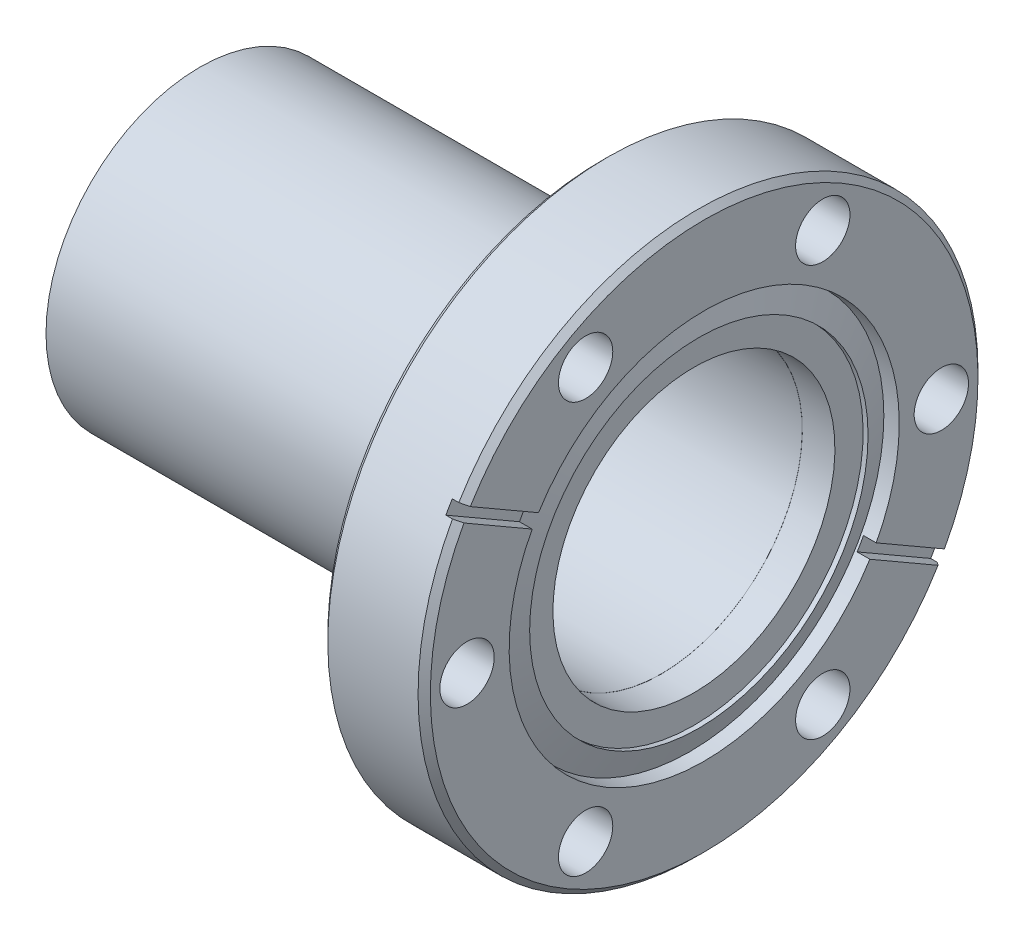
ISO-10303-21;
HEADER;
FILE_DESCRIPTION(('STEP AP214'),'2;1');
FILE_NAME('part.step','',(''),(''),'','','');
FILE_SCHEMA(('AUTOMOTIVE_DESIGN { 1 0 10303 214 1 1 1 1 }'));
ENDSEC;
DATA;
#1=APPLICATION_CONTEXT('core data for automotive mechanical design processes');
#2=APPLICATION_PROTOCOL_DEFINITION('international standard','automotive_design',2000,#1);
#3=PRODUCT_CONTEXT('',#1,'mechanical');
#4=PRODUCT('Part','Part','',(#3));
#5=PRODUCT_RELATED_PRODUCT_CATEGORY('part','',(#4));
#6=PRODUCT_DEFINITION_FORMATION('','',#4);
#7=PRODUCT_DEFINITION_CONTEXT('part definition',#1,'design');
#8=PRODUCT_DEFINITION('design','',#6,#7);
#9=PRODUCT_DEFINITION_SHAPE('','',#8);
#10=(LENGTH_UNIT() NAMED_UNIT(*) SI_UNIT(.MILLI.,.METRE.));
#11=(NAMED_UNIT(*) PLANE_ANGLE_UNIT() SI_UNIT($,.RADIAN.));
#12=(NAMED_UNIT(*) SI_UNIT($,.STERADIAN.) SOLID_ANGLE_UNIT());
#13=UNCERTAINTY_MEASURE_WITH_UNIT(LENGTH_MEASURE(1.E-05),#10,'distance_accuracy_value','');
#14=(GEOMETRIC_REPRESENTATION_CONTEXT(3) GLOBAL_UNCERTAINTY_ASSIGNED_CONTEXT((#13)) GLOBAL_UNIT_ASSIGNED_CONTEXT((#10,
#11,#12)) REPRESENTATION_CONTEXT('',''));
#15=CARTESIAN_POINT('',(0.,0.,0.));
#16=DIRECTION('',(0.,0.,1.));
#17=DIRECTION('',(1.,0.,0.));
#18=AXIS2_PLACEMENT_3D('',#15,#16,#17);
#19=CARTESIAN_POINT('',(7.39140000000005,0.,0.));
#20=DIRECTION('',(-1.,0.,0.));
#21=DIRECTION('',(0.,-1.,0.));
#22=AXIS2_PLACEMENT_3D('',#19,#20,#21);
#23=CYLINDRICAL_SURFACE('',#22,17.4498);
#24=CARTESIAN_POINT('',(7.39140000000005,0.,0.));
#25=DIRECTION('',(-1.,0.,0.));
#26=DIRECTION('',(0.,-1.,0.));
#27=AXIS2_PLACEMENT_3D('',#24,#25,#26);
#28=CIRCLE('',#27,17.4498);
#29=CARTESIAN_POINT('',(7.39140000000005,-17.4498,0.));
#30=VERTEX_POINT('',#29);
#31=EDGE_CURVE('P0_E38',#30,#30,#28,.F.);
#32=ORIENTED_EDGE('',*,*,#31,.T.);
#33=EDGE_LOOP('',(#32));
#34=FACE_BOUND('',#33,.T.);
#35=CARTESIAN_POINT('',(-47.2185999999999,0.,0.));
#36=DIRECTION('',(-1.,0.,0.));
#37=DIRECTION('',(0.,-1.,0.));
#38=AXIS2_PLACEMENT_3D('',#35,#36,#37);
#39=CIRCLE('',#38,17.4498);
#40=CARTESIAN_POINT('',(-47.2186,-17.4498,0.));
#41=VERTEX_POINT('',#40);
#42=EDGE_CURVE('P0_E10',#41,#41,#39,.F.);
#43=ORIENTED_EDGE('',*,*,#42,.F.);
#44=EDGE_LOOP('',(#43));
#45=FACE_BOUND('',#44,.T.);
#46=ADVANCED_FACE('P0_F35',(#34,#45),#23,.F.);
#47=CARTESIAN_POINT('',(-49.7585999999999,0.,0.));
#48=DIRECTION('',(-1.,0.,0.));
#49=DIRECTION('',(0.,-1.,0.));
#50=AXIS2_PLACEMENT_3D('',#47,#48,#49);
#51=PLANE('',#50);
#52=CARTESIAN_POINT('',(-49.7585999999999,0.,0.));
#53=DIRECTION('',(1.,0.,0.));
#54=DIRECTION('',(0.,1.,0.));
#55=AXIS2_PLACEMENT_3D('',#52,#53,#54);
#56=CIRCLE('',#55,19.05);
#57=CARTESIAN_POINT('',(-49.7585999999999,19.05,0.));
#58=VERTEX_POINT('',#57);
#59=EDGE_CURVE('P0_E47',#58,#58,#56,.T.);
#60=ORIENTED_EDGE('',*,*,#59,.F.);
#61=EDGE_LOOP('',(#60));
#62=FACE_BOUND('',#61,.T.);
#63=ADVANCED_FACE('P0_F60',(#62),#51,.T.);
#64=CARTESIAN_POINT('',(7.39140000000005,0.,0.));
#65=DIRECTION('',(-1.,0.,0.));
#66=DIRECTION('',(0.,-1.,0.));
#67=AXIS2_PLACEMENT_3D('',#64,#65,#66);
#68=PLANE('',#67);
#69=CARTESIAN_POINT('',(7.39140000000006,0.,0.));
#70=DIRECTION('',(1.,0.,0.));
#71=DIRECTION('',(0.,1.,0.));
#72=AXIS2_PLACEMENT_3D('',#69,#70,#71);
#73=CIRCLE('',#72,19.05);
#74=CARTESIAN_POINT('',(7.39140000000006,19.05,0.));
#75=VERTEX_POINT('',#74);
#76=EDGE_CURVE('P0_E42',#75,#75,#73,.F.);
#77=ORIENTED_EDGE('',*,*,#76,.F.);
#78=EDGE_LOOP('',(#77));
#79=FACE_BOUND('',#78,.T.);
#80=ORIENTED_EDGE('',*,*,#31,.F.);
#81=EDGE_LOOP('',(#80));
#82=FACE_BOUND('',#81,.T.);
#83=ADVANCED_FACE('P0_F57',(#79,#82),#68,.F.);
#84=CARTESIAN_POINT('',(-49.7585999999999,0.,0.));
#85=DIRECTION('',(1.,0.,0.));
#86=DIRECTION('',(0.,1.,0.));
#87=AXIS2_PLACEMENT_3D('',#84,#85,#86);
#88=CYLINDRICAL_SURFACE('',#87,19.05);
#89=ORIENTED_EDGE('',*,*,#59,.T.);
#90=EDGE_LOOP('',(#89));
#91=FACE_BOUND('',#90,.T.);
#92=ORIENTED_EDGE('',*,*,#76,.T.);
#93=EDGE_LOOP('',(#92));
#94=FACE_BOUND('',#93,.T.);
#95=ADVANCED_FACE('P0_F59',(#91,#94),#88,.T.);
#96=CARTESIAN_POINT('',(-47.2185999999999,0.,0.));
#97=DIRECTION('',(-1.,0.,0.));
#98=DIRECTION('',(0.,-1.,0.));
#99=AXIS2_PLACEMENT_3D('',#96,#97,#98);
#100=PLANE('',#99);
#101=ORIENTED_EDGE('',*,*,#42,.T.);
#102=EDGE_LOOP('',(#101));
#103=FACE_BOUND('',#102,.T.);
#104=ADVANCED_FACE('P0_F69',(#103),#100,.F.);
#105=CLOSED_SHELL('',(#46,#63,#83,#95,#104));
#106=MANIFOLD_SOLID_BREP('P0_B2',#105);
#107=CARTESIAN_POINT('',(11.1252,0.,0.));
#108=DIRECTION('',(1.,0.,0.));
#109=DIRECTION('',(0.,1.,0.));
#110=AXIS2_PLACEMENT_3D('',#107,#108,#109);
#111=PLANE('',#110);
#112=CARTESIAN_POINT('',(11.1252,0.,0.));
#113=DIRECTION('',(-1.,0.,0.));
#114=DIRECTION('',(0.,0.,1.));
#115=AXIS2_PLACEMENT_3D('',#112,#113,#114);
#116=CIRCLE('',#115,34.671);
#117=CARTESIAN_POINT('',(11.1252,18.0129372402592,29.6245224936789));
#118=VERTEX_POINT('',#117);
#119=CARTESIAN_POINT('',(11.1252,16.6491204343794,30.4119224936789));
#120=VERTEX_POINT('',#119);
#121=EDGE_CURVE('P1_E107',#118,#120,#116,.F.);
#122=ORIENTED_EDGE('',*,*,#121,.T.);
#123=DIRECTION('',(0.,-0.499999999999993,-0.866025403784442));
#124=VECTOR('',#123,1.);
#125=CARTESIAN_POINT('',(11.1252,11.3893731197485,21.3017729097639));
#126=LINE('',#125,#124);
#127=CARTESIAN_POINT('',(11.1252,11.3893731197485,21.3017729097639));
#128=VERTEX_POINT('',#127);
#129=EDGE_CURVE('P1_E105',#120,#128,#126,.T.);
#130=ORIENTED_EDGE('',*,*,#129,.T.);
#131=CARTESIAN_POINT('',(11.1252,0.,0.));
#132=DIRECTION('',(1.,0.,0.));
#133=DIRECTION('',(0.,0.,-1.));
#134=AXIS2_PLACEMENT_3D('',#131,#132,#133);
#135=CIRCLE('',#134,24.1554);
#136=CARTESIAN_POINT('',(11.1252,12.7531899256282,20.5143729097639));
#137=VERTEX_POINT('',#136);
#138=EDGE_CURVE('P1_E28',#128,#137,#135,.F.);
#139=ORIENTED_EDGE('',*,*,#138,.T.);
#140=DIRECTION('',(0.,0.499999999999994,0.866025403784442));
#141=VECTOR('',#140,1.);
#142=CARTESIAN_POINT('',(11.1252,18.0129372402592,29.6245224936789));
#143=LINE('',#142,#141);
#144=EDGE_CURVE('P1_E102',#137,#118,#143,.T.);
#145=ORIENTED_EDGE('',*,*,#144,.T.);
#146=EDGE_LOOP('',(#122,#130,#139,#145));
#147=FACE_BOUND('',#146,.T.);
#148=ADVANCED_FACE('P1_F25',(#147),#111,.T.);
#149=CARTESIAN_POINT('',(11.1252,0.,0.));
#150=DIRECTION('',(1.,0.,0.));
#151=DIRECTION('',(0.,1.,0.));
#152=AXIS2_PLACEMENT_3D('',#149,#150,#151);
#153=PLANE('',#152);
#154=CARTESIAN_POINT('',(11.1252,0.,0.));
#155=DIRECTION('',(-1.,0.,0.));
#156=DIRECTION('',(0.,0.,1.));
#157=AXIS2_PLACEMENT_3D('',#154,#155,#156);
#158=CIRCLE('',#157,34.671);
#159=CARTESIAN_POINT('',(11.1252,-18.0129372402594,-29.6245224936787));
#160=VERTEX_POINT('',#159);
#161=CARTESIAN_POINT('',(11.1252,-16.6491204343796,-30.4119224936787));
#162=VERTEX_POINT('',#161);
#163=EDGE_CURVE('P1_E161',#160,#162,#158,.F.);
#164=ORIENTED_EDGE('',*,*,#163,.T.);
#165=DIRECTION('',(0.,0.5,0.866025403784439));
#166=VECTOR('',#165,1.);
#167=CARTESIAN_POINT('',(11.1252,-11.3893731197486,-21.3017729097638));
#168=LINE('',#167,#166);
#169=CARTESIAN_POINT('',(11.1252,-11.3893731197486,-21.3017729097638));
#170=VERTEX_POINT('',#169);
#171=EDGE_CURVE('P1_E158',#162,#170,#168,.T.);
#172=ORIENTED_EDGE('',*,*,#171,.T.);
#173=CARTESIAN_POINT('',(11.1252,0.,0.));
#174=DIRECTION('',(1.,0.,0.));
#175=DIRECTION('',(0.,0.,-1.));
#176=AXIS2_PLACEMENT_3D('',#173,#174,#175);
#177=CIRCLE('',#176,24.1554);
#178=CARTESIAN_POINT('',(11.1252,-12.7531899256283,-20.5143729097638));
#179=VERTEX_POINT('',#178);
#180=EDGE_CURVE('P1_E349',#170,#179,#177,.F.);
#181=ORIENTED_EDGE('',*,*,#180,.T.);
#182=DIRECTION('',(0.,-0.5,-0.866025403784439));
#183=VECTOR('',#182,1.);
#184=CARTESIAN_POINT('',(11.1252,-18.0129372402594,-29.6245224936787));
#185=LINE('',#184,#183);
#186=EDGE_CURVE('P1_E144',#179,#160,#185,.T.);
#187=ORIENTED_EDGE('',*,*,#186,.T.);
#188=EDGE_LOOP('',(#164,#172,#181,#187));
#189=FACE_BOUND('',#188,.T.);
#190=ADVANCED_FACE('P1_F264',(#189),#153,.T.);
#191=CARTESIAN_POINT('',(5.08,0.,0.));
#192=DIRECTION('',(1.,0.,0.));
#193=DIRECTION('',(0.,1.,0.));
#194=AXIS2_PLACEMENT_3D('',#191,#192,#193);
#195=PLANE('',#194);
#196=CARTESIAN_POINT('',(5.08,0.,0.));
#197=DIRECTION('',(1.,0.,0.));
#198=DIRECTION('',(0.,0.,-1.));
#199=AXIS2_PLACEMENT_3D('',#196,#197,#198);
#200=CIRCLE('',#199,19.812);
#201=CARTESIAN_POINT('',(5.08,0.,-19.812));
#202=VERTEX_POINT('',#201);
#203=EDGE_CURVE('P1_E137',#202,#202,#200,.F.);
#204=ORIENTED_EDGE('',*,*,#203,.T.);
#205=EDGE_LOOP('',(#204));
#206=FACE_BOUND('',#205,.T.);
#207=CARTESIAN_POINT('',(5.08,0.,0.));
#208=DIRECTION('',(1.,0.,0.));
#209=DIRECTION('',(0.,0.,-1.));
#210=AXIS2_PLACEMENT_3D('',#207,#208,#209);
#211=CIRCLE('',#210,24.1554);
#212=CARTESIAN_POINT('',(5.08,0.,-24.1554));
#213=VERTEX_POINT('',#212);
#214=EDGE_CURVE('P1_E123',#213,#213,#211,.T.);
#215=ORIENTED_EDGE('',*,*,#214,.T.);
#216=EDGE_LOOP('',(#215));
#217=FACE_BOUND('',#216,.T.);
#218=ADVANCED_FACE('P1_F261',(#206,#217),#195,.T.);
#219=CARTESIAN_POINT('',(11.1252,-11.3893731197486,-21.3017729097638));
#220=DIRECTION('',(0.,0.866025403784439,-0.5));
#221=DIRECTION('',(0.,0.5,0.866025403784439));
#222=AXIS2_PLACEMENT_3D('',#219,#220,#221);
#223=PLANE('',#222);
#224=CARTESIAN_POINT('',(12.7,-16.2680199320119,-29.7518370607878));
#225=CARTESIAN_POINT('',(12.5730003723783,-16.3315368685465,-29.8618516220069));
#226=CARTESIAN_POINT('',(12.4460005585674,-16.3950537120112,-29.9718660220241));
#227=CARTESIAN_POINT('',(12.1920005585674,-16.5220872128004,-30.1918944996544));
#228=CARTESIAN_POINT('',(12.0650003723783,-16.585603870125,-30.3019085772676));
#229=CARTESIAN_POINT('',(11.938,-16.6491204343796,-30.4119224936787));
#230=B_SPLINE_CURVE_WITH_KNOTS('',3,(#224,#225,#226,#227,#228,#229),.UNSPECIFIED.,.F.,.F.,(4,2,
4),(0.,0.538886437856431,1.07777287571284),.UNSPECIFIED.);
#231=CARTESIAN_POINT('',(12.7,-16.2680199320119,-29.7518370607878));
#232=VERTEX_POINT('',#231);
#233=CARTESIAN_POINT('',(11.938,-16.6491204343796,-30.4119224936787));
#234=VERTEX_POINT('',#233);
#235=EDGE_CURVE('P1_E117',#232,#234,#230,.T.);
#236=ORIENTED_EDGE('',*,*,#235,.F.);
#237=DIRECTION('',(0.,-0.499999999999999,-0.866025403784439));
#238=VECTOR('',#237,1.);
#239=CARTESIAN_POINT('',(12.7,-11.3893731197486,-21.3017729097638));
#240=LINE('',#239,#238);
#241=CARTESIAN_POINT('',(12.7,-11.3893731197486,-21.3017729097638));
#242=VERTEX_POINT('',#241);
#243=EDGE_CURVE('P1_E213',#242,#232,#240,.T.);
#244=ORIENTED_EDGE('',*,*,#243,.F.);
#245=DIRECTION('',(1.,0.,0.));
#246=VECTOR('',#245,1.);
#247=CARTESIAN_POINT('',(5.08,-11.3893731197486,-21.3017729097638));
#248=LINE('',#247,#246);
#249=EDGE_CURVE('P1_E133',#242,#170,#248,.F.);
#250=ORIENTED_EDGE('',*,*,#249,.T.);
#251=ORIENTED_EDGE('',*,*,#171,.F.);
#252=DIRECTION('',(-1.,0.,0.));
#253=VECTOR('',#252,1.);
#254=CARTESIAN_POINT('',(12.7,-16.6491204343796,-30.4119224936787));
#255=LINE('',#254,#253);
#256=EDGE_CURVE('P1_E143',#234,#162,#255,.T.);
#257=ORIENTED_EDGE('',*,*,#256,.F.);
#258=EDGE_LOOP('',(#236,#244,#250,#251,#257));
#259=FACE_BOUND('',#258,.T.);
#260=ADVANCED_FACE('P1_F257',(#259),#223,.F.);
#261=CARTESIAN_POINT('',(11.938,0.,0.));
#262=DIRECTION('',(-1.,0.,0.));
#263=DIRECTION('',(0.,0.,1.));
#264=AXIS2_PLACEMENT_3D('',#261,#262,#263);
#265=CONICAL_SURFACE('',#264,34.671,0.785398163397442);
#266=CARTESIAN_POINT('',(11.938,18.0129372402592,29.6245224936789));
#267=CARTESIAN_POINT('',(12.0650003723783,17.9494206760046,29.5145085772677));
#268=CARTESIAN_POINT('',(12.1920005585674,17.88590401868,29.4044944996545));
#269=CARTESIAN_POINT('',(12.4460005585674,17.7588705178907,29.1844660220242));
#270=CARTESIAN_POINT('',(12.5730003723783,17.6953536744261,29.0744516220071));
#271=CARTESIAN_POINT('',(12.7,17.6318367378914,28.9644370607879));
#272=B_SPLINE_CURVE_WITH_KNOTS('',3,(#266,#267,#268,#269,#270,#271),.UNSPECIFIED.,.F.,.F.,(4,2,
4),(0.,0.538886437856404,1.07777287571283),.UNSPECIFIED.);
#273=CARTESIAN_POINT('',(11.938,18.0129372402592,29.6245224936789));
#274=VERTEX_POINT('',#273);
#275=CARTESIAN_POINT('',(12.7,17.6318367378914,28.9644370607879));
#276=VERTEX_POINT('',#275);
#277=EDGE_CURVE('P1_E116',#274,#276,#272,.T.);
#278=ORIENTED_EDGE('',*,*,#277,.T.);
#279=CARTESIAN_POINT('',(12.7,0.,0.));
#280=DIRECTION('',(-1.,0.,0.));
#281=DIRECTION('',(0.,0.,1.));
#282=AXIS2_PLACEMENT_3D('',#279,#280,#281);
#283=CIRCLE('',#282,33.909);
#284=EDGE_CURVE('P1_E211',#232,#276,#283,.F.);
#285=ORIENTED_EDGE('',*,*,#284,.F.);
#286=ORIENTED_EDGE('',*,*,#235,.T.);
#287=CARTESIAN_POINT('',(11.938,0.,0.));
#288=DIRECTION('',(-1.,0.,0.));
#289=DIRECTION('',(0.,0.,1.));
#290=AXIS2_PLACEMENT_3D('',#287,#288,#289);
#291=CIRCLE('',#290,34.671);
#292=EDGE_CURVE('P1_E149',#274,#234,#291,.T.);
#293=ORIENTED_EDGE('',*,*,#292,.F.);
#294=EDGE_LOOP('',(#278,#285,#286,#293));
#295=FACE_BOUND('',#294,.T.);
#296=ADVANCED_FACE('P1_F244',(#295),#265,.T.);
#297=CARTESIAN_POINT('',(11.1252,18.0129372402592,29.6245224936789));
#298=DIRECTION('',(0.,0.866025403784442,-0.499999999999994));
#299=DIRECTION('',(0.,0.499999999999994,0.866025403784442));
#300=AXIS2_PLACEMENT_3D('',#297,#298,#299);
#301=PLANE('',#300);
#302=ORIENTED_EDGE('',*,*,#277,.F.);
#303=DIRECTION('',(-1.,0.,0.));
#304=VECTOR('',#303,1.);
#305=CARTESIAN_POINT('',(12.7,18.0129372402592,29.6245224936789));
#306=LINE('',#305,#304);
#307=EDGE_CURVE('P1_E115',#118,#274,#306,.F.);
#308=ORIENTED_EDGE('',*,*,#307,.F.);
#309=ORIENTED_EDGE('',*,*,#144,.F.);
#310=DIRECTION('',(1.,0.,0.));
#311=VECTOR('',#310,1.);
#312=CARTESIAN_POINT('',(5.08,12.7531899256282,20.5143729097639));
#313=LINE('',#312,#311);
#314=CARTESIAN_POINT('',(12.7,12.7531899256282,20.5143729097639));
#315=VERTEX_POINT('',#314);
#316=EDGE_CURVE('P1_E113',#137,#315,#313,.T.);
#317=ORIENTED_EDGE('',*,*,#316,.T.);
#318=DIRECTION('',(0.,-0.499999999999994,-0.866025403784442));
#319=VECTOR('',#318,1.);
#320=CARTESIAN_POINT('',(12.7,17.6318367378914,28.9644370607879));
#321=LINE('',#320,#319);
#322=EDGE_CURVE('P1_E210',#276,#315,#321,.T.);
#323=ORIENTED_EDGE('',*,*,#322,.F.);
#324=EDGE_LOOP('',(#302,#308,#309,#317,#323));
#325=FACE_BOUND('',#324,.T.);
#326=ADVANCED_FACE('P1_F111',(#325),#301,.F.);
#327=CARTESIAN_POINT('',(11.1252,11.3893731197485,21.3017729097639));
#328=DIRECTION('',(0.,-0.866025403784442,0.499999999999993));
#329=DIRECTION('',(0.,-0.499999999999993,-0.866025403784442));
#330=AXIS2_PLACEMENT_3D('',#327,#328,#329);
#331=PLANE('',#330);
#332=CARTESIAN_POINT('',(12.7,16.2680199320117,29.7518370607879));
#333=CARTESIAN_POINT('',(12.5730003723783,16.3315368685463,29.861851622007));
#334=CARTESIAN_POINT('',(12.4460005585674,16.395053712011,29.9718660220242));
#335=CARTESIAN_POINT('',(12.1920005585674,16.5220872128002,30.1918944996545));
#336=CARTESIAN_POINT('',(12.0650003723783,16.5856038701248,30.3019085772677));
#337=CARTESIAN_POINT('',(11.938,16.6491204343794,30.4119224936789));
#338=B_SPLINE_CURVE_WITH_KNOTS('',3,(#332,#333,#334,#335,#336,#337),.UNSPECIFIED.,.F.,.F.,(4,2,
4),(0.,0.538886437856433,1.07777287571284),.UNSPECIFIED.);
#339=CARTESIAN_POINT('',(12.7,16.2680199320117,29.7518370607879));
#340=VERTEX_POINT('',#339);
#341=CARTESIAN_POINT('',(11.938,16.6491204343794,30.4119224936789));
#342=VERTEX_POINT('',#341);
#343=EDGE_CURVE('P1_E148',#340,#342,#338,.T.);
#344=ORIENTED_EDGE('',*,*,#343,.F.);
#345=DIRECTION('',(0.,0.499999999999994,0.866025403784442));
#346=VECTOR('',#345,1.);
#347=CARTESIAN_POINT('',(12.7,11.3893731197485,21.3017729097639));
#348=LINE('',#347,#346);
#349=CARTESIAN_POINT('',(12.7,11.3893731197485,21.3017729097639));
#350=VERTEX_POINT('',#349);
#351=EDGE_CURVE('P1_E208',#350,#340,#348,.T.);
#352=ORIENTED_EDGE('',*,*,#351,.F.);
#353=DIRECTION('',(1.,0.,0.));
#354=VECTOR('',#353,1.);
#355=CARTESIAN_POINT('',(5.08,11.3893731197485,21.3017729097639));
#356=LINE('',#355,#354);
#357=EDGE_CURVE('P1_E124',#350,#128,#356,.F.);
#358=ORIENTED_EDGE('',*,*,#357,.T.);
#359=ORIENTED_EDGE('',*,*,#129,.F.);
#360=DIRECTION('',(-1.,0.,0.));
#361=VECTOR('',#360,1.);
#362=CARTESIAN_POINT('',(12.7,16.6491204343794,30.4119224936789));
#363=LINE('',#362,#361);
#364=EDGE_CURVE('P1_E127',#342,#120,#363,.T.);
#365=ORIENTED_EDGE('',*,*,#364,.F.);
#366=EDGE_LOOP('',(#344,#352,#358,#359,#365));
#367=FACE_BOUND('',#366,.T.);
#368=ADVANCED_FACE('P1_F234',(#367),#331,.F.);
#369=CARTESIAN_POINT('',(11.938,0.,0.));
#370=DIRECTION('',(-1.,0.,0.));
#371=DIRECTION('',(0.,0.,1.));
#372=AXIS2_PLACEMENT_3D('',#369,#370,#371);
#373=CONICAL_SURFACE('',#372,34.671,0.785398163397452);
#374=CARTESIAN_POINT('',(11.938,0.,0.));
#375=DIRECTION('',(-1.,0.,0.));
#376=DIRECTION('',(0.,0.,1.));
#377=AXIS2_PLACEMENT_3D('',#374,#375,#376);
#378=CIRCLE('',#377,34.671);
#379=CARTESIAN_POINT('',(11.938,-18.0129372402594,-29.6245224936787));
#380=VERTEX_POINT('',#379);
#381=EDGE_CURVE('P1_E135',#380,#342,#378,.T.);
#382=ORIENTED_EDGE('',*,*,#381,.F.);
#383=CARTESIAN_POINT('',(11.938,-18.0129372402594,-29.6245224936787));
#384=CARTESIAN_POINT('',(12.0650003723783,-17.9494206760048,-29.5145085772676));
#385=CARTESIAN_POINT('',(12.1920005585674,-17.8859040186802,-29.4044944996544));
#386=CARTESIAN_POINT('',(12.4460005585674,-17.7588705178909,-29.1844660220241));
#387=CARTESIAN_POINT('',(12.5730003723783,-17.6953536744263,-29.0744516220069));
#388=CARTESIAN_POINT('',(12.7,-17.6318367378916,-28.9644370607878));
#389=B_SPLINE_CURVE_WITH_KNOTS('',3,(#383,#384,#385,#386,#387,#388),.UNSPECIFIED.,.F.,.F.,(4,2,
4),(0.,0.538886437856412,1.07777287571285),.UNSPECIFIED.);
#390=CARTESIAN_POINT('',(12.7,-17.6318367378916,-28.9644370607878));
#391=VERTEX_POINT('',#390);
#392=EDGE_CURVE('P1_E147',#380,#391,#389,.T.);
#393=ORIENTED_EDGE('',*,*,#392,.T.);
#394=CARTESIAN_POINT('',(12.7,0.,0.));
#395=DIRECTION('',(-1.,0.,0.));
#396=DIRECTION('',(0.,0.,1.));
#397=AXIS2_PLACEMENT_3D('',#394,#395,#396);
#398=CIRCLE('',#397,33.909);
#399=EDGE_CURVE('P1_E206',#340,#391,#398,.F.);
#400=ORIENTED_EDGE('',*,*,#399,.F.);
#401=ORIENTED_EDGE('',*,*,#343,.T.);
#402=EDGE_LOOP('',(#382,#393,#400,#401));
#403=FACE_BOUND('',#402,.T.);
#404=ADVANCED_FACE('P1_F231',(#403),#373,.T.);
#405=CARTESIAN_POINT('',(11.1252,-18.0129372402594,-29.6245224936787));
#406=DIRECTION('',(0.,-0.866025403784439,0.5));
#407=DIRECTION('',(0.,-0.5,-0.866025403784439));
#408=AXIS2_PLACEMENT_3D('',#405,#406,#407);
#409=PLANE('',#408);
#410=ORIENTED_EDGE('',*,*,#392,.F.);
#411=DIRECTION('',(-1.,0.,0.));
#412=VECTOR('',#411,1.);
#413=CARTESIAN_POINT('',(12.7,-18.0129372402594,-29.6245224936787));
#414=LINE('',#413,#412);
#415=EDGE_CURVE('P1_E138',#160,#380,#414,.F.);
#416=ORIENTED_EDGE('',*,*,#415,.F.);
#417=ORIENTED_EDGE('',*,*,#186,.F.);
#418=DIRECTION('',(1.,0.,0.));
#419=VECTOR('',#418,1.);
#420=CARTESIAN_POINT('',(5.08,-12.7531899256283,-20.5143729097638));
#421=LINE('',#420,#419);
#422=CARTESIAN_POINT('',(12.7,-12.7531899256283,-20.5143729097638));
#423=VERTEX_POINT('',#422);
#424=EDGE_CURVE('P1_E129',#179,#423,#421,.T.);
#425=ORIENTED_EDGE('',*,*,#424,.T.);
#426=DIRECTION('',(0.,0.5,0.866025403784439));
#427=VECTOR('',#426,1.);
#428=CARTESIAN_POINT('',(12.7,-17.6318367378916,-28.9644370607878));
#429=LINE('',#428,#427);
#430=EDGE_CURVE('P1_E205',#391,#423,#429,.T.);
#431=ORIENTED_EDGE('',*,*,#430,.F.);
#432=EDGE_LOOP('',(#410,#416,#417,#425,#431));
#433=FACE_BOUND('',#432,.T.);
#434=ADVANCED_FACE('P1_F228',(#433),#409,.F.);
#435=CARTESIAN_POINT('',(5.08,0.,0.));
#436=DIRECTION('',(1.,0.,0.));
#437=DIRECTION('',(0.,0.,-1.));
#438=AXIS2_PLACEMENT_3D('',#435,#436,#437);
#439=CYLINDRICAL_SURFACE('',#438,24.1554);
#440=ORIENTED_EDGE('',*,*,#214,.F.);
#441=EDGE_LOOP('',(#440));
#442=FACE_BOUND('',#441,.T.);
#443=CARTESIAN_POINT('',(12.7,0.,0.));
#444=DIRECTION('',(1.,0.,0.));
#445=DIRECTION('',(0.,0.,-1.));
#446=AXIS2_PLACEMENT_3D('',#443,#444,#445);
#447=CIRCLE('',#446,24.1554);
#448=EDGE_CURVE('P1_E121',#315,#242,#447,.F.);
#449=ORIENTED_EDGE('',*,*,#448,.F.);
#450=ORIENTED_EDGE('',*,*,#316,.F.);
#451=ORIENTED_EDGE('',*,*,#138,.F.);
#452=ORIENTED_EDGE('',*,*,#357,.F.);
#453=CARTESIAN_POINT('',(12.7,0.,0.));
#454=DIRECTION('',(1.,0.,0.));
#455=DIRECTION('',(0.,0.,-1.));
#456=AXIS2_PLACEMENT_3D('',#453,#454,#455);
#457=CIRCLE('',#456,24.1554);
#458=EDGE_CURVE('P1_E43',#423,#350,#457,.F.);
#459=ORIENTED_EDGE('',*,*,#458,.F.);
#460=ORIENTED_EDGE('',*,*,#424,.F.);
#461=ORIENTED_EDGE('',*,*,#180,.F.);
#462=ORIENTED_EDGE('',*,*,#249,.F.);
#463=EDGE_LOOP('',(#449,#450,#451,#452,#459,#460,#461,#462));
#464=FACE_BOUND('',#463,.T.);
#465=ADVANCED_FACE('P1_F119',(#442,#464),#439,.F.);
#466=CARTESIAN_POINT('',(12.7,0.,0.));
#467=DIRECTION('',(-1.,0.,0.));
#468=DIRECTION('',(0.,0.,1.));
#469=AXIS2_PLACEMENT_3D('',#466,#467,#468);
#470=CYLINDRICAL_SURFACE('',#469,34.671);
#471=ORIENTED_EDGE('',*,*,#307,.T.);
#472=ORIENTED_EDGE('',*,*,#292,.T.);
#473=ORIENTED_EDGE('',*,*,#256,.T.);
#474=ORIENTED_EDGE('',*,*,#163,.F.);
#475=ORIENTED_EDGE('',*,*,#415,.T.);
#476=ORIENTED_EDGE('',*,*,#381,.T.);
#477=ORIENTED_EDGE('',*,*,#364,.T.);
#478=ORIENTED_EDGE('',*,*,#121,.F.);
#479=EDGE_LOOP('',(#471,#472,#473,#474,#475,#476,#477,#478));
#480=FACE_BOUND('',#479,.T.);
#481=CARTESIAN_POINT('',(0.761999999999971,0.,0.));
#482=DIRECTION('',(1.,0.,0.));
#483=DIRECTION('',(0.,1.,0.));
#484=AXIS2_PLACEMENT_3D('',#481,#482,#483);
#485=CIRCLE('',#484,34.671);
#486=CARTESIAN_POINT('',(0.761999999999974,34.671,2.41789397435817E-13));
#487=VERTEX_POINT('',#486);
#488=EDGE_CURVE('P1_E204',#487,#487,#485,.F.);
#489=ORIENTED_EDGE('',*,*,#488,.F.);
#490=EDGE_LOOP('',(#489));
#491=FACE_BOUND('',#490,.T.);
#492=ADVANCED_FACE('P1_F324',(#480,#491),#470,.T.);
#493=CARTESIAN_POINT('',(0.,0.,0.));
#494=DIRECTION('',(1.,0.,0.));
#495=DIRECTION('',(0.,0.,-1.));
#496=AXIS2_PLACEMENT_3D('',#493,#494,#495);
#497=CYLINDRICAL_SURFACE('',#496,19.812);
#498=ORIENTED_EDGE('',*,*,#203,.F.);
#499=EDGE_LOOP('',(#498));
#500=FACE_BOUND('',#499,.T.);
#501=CARTESIAN_POINT('',(4.31800000000002,0.,0.));
#502=DIRECTION('',(-1.,0.,0.));
#503=DIRECTION('',(0.,-1.,0.));
#504=AXIS2_PLACEMENT_3D('',#501,#502,#503);
#505=CIRCLE('',#504,19.812);
#506=CARTESIAN_POINT('',(4.31800000000002,-19.812,-1.38165369963324E-13));
#507=VERTEX_POINT('',#506);
#508=EDGE_CURVE('P1_E202',#507,#507,#505,.T.);
#509=ORIENTED_EDGE('',*,*,#508,.T.);
#510=EDGE_LOOP('',(#509));
#511=FACE_BOUND('',#510,.T.);
#512=ADVANCED_FACE('P1_F320',(#500,#511),#497,.F.);
#513=CARTESIAN_POINT('',(12.7,0.,0.));
#514=DIRECTION('',(1.,0.,0.));
#515=DIRECTION('',(0.,1.,0.));
#516=AXIS2_PLACEMENT_3D('',#513,#514,#515);
#517=PLANE('',#516);
#518=CARTESIAN_POINT('',(12.7,0.,-29.36875));
#519=DIRECTION('',(1.,0.,0.));
#520=DIRECTION('',(0.,0.,-1.));
#521=AXIS2_PLACEMENT_3D('',#518,#519,#520);
#522=CIRCLE('',#521,3.3655);
#523=CARTESIAN_POINT('',(12.7,0.,-32.73425));
#524=VERTEX_POINT('',#523);
#525=EDGE_CURVE('P1_E193',#524,#524,#522,.F.);
#526=ORIENTED_EDGE('',*,*,#525,.T.);
#527=EDGE_LOOP('',(#526));
#528=FACE_BOUND('',#527,.T.);
#529=CARTESIAN_POINT('',(12.7,25.4340835773943,-14.6843749999999));
#530=DIRECTION('',(1.,0.,0.));
#531=DIRECTION('',(0.,0.,-1.));
#532=AXIS2_PLACEMENT_3D('',#529,#530,#531);
#533=CIRCLE('',#532,3.3655);
#534=CARTESIAN_POINT('',(12.7,25.4340835773943,-18.049875));
#535=VERTEX_POINT('',#534);
#536=EDGE_CURVE('P1_E190',#535,#535,#533,.F.);
#537=ORIENTED_EDGE('',*,*,#536,.T.);
#538=EDGE_LOOP('',(#537));
#539=FACE_BOUND('',#538,.T.);
#540=CARTESIAN_POINT('',(12.7,25.4340835773942,14.6843750000001));
#541=DIRECTION('',(1.,0.,0.));
#542=DIRECTION('',(0.,0.,-1.));
#543=AXIS2_PLACEMENT_3D('',#540,#541,#542);
#544=CIRCLE('',#543,3.3655);
#545=CARTESIAN_POINT('',(12.7,25.4340835773942,11.3188750000001));
#546=VERTEX_POINT('',#545);
#547=EDGE_CURVE('P1_E187',#546,#546,#544,.F.);
#548=ORIENTED_EDGE('',*,*,#547,.T.);
#549=EDGE_LOOP('',(#548));
#550=FACE_BOUND('',#549,.T.);
#551=ORIENTED_EDGE('',*,*,#322,.T.);
#552=ORIENTED_EDGE('',*,*,#448,.T.);
#553=ORIENTED_EDGE('',*,*,#243,.T.);
#554=ORIENTED_EDGE('',*,*,#284,.T.);
#555=EDGE_LOOP('',(#551,#552,#553,#554));
#556=FACE_BOUND('',#555,.T.);
#557=ADVANCED_FACE('P1_F316',(#528,#539,#550,#556),#517,.T.);
#558=CARTESIAN_POINT('',(12.7,0.,0.));
#559=DIRECTION('',(1.,0.,0.));
#560=DIRECTION('',(0.,1.,0.));
#561=AXIS2_PLACEMENT_3D('',#558,#559,#560);
#562=PLANE('',#561);
#563=CARTESIAN_POINT('',(12.7,-2.04812447461658E-13,29.36875));
#564=DIRECTION('',(1.,0.,0.));
#565=DIRECTION('',(0.,0.,-1.));
#566=AXIS2_PLACEMENT_3D('',#563,#564,#565);
#567=CIRCLE('',#566,3.3655);
#568=CARTESIAN_POINT('',(12.7,-2.04812447461658E-13,26.00325));
#569=VERTEX_POINT('',#568);
#570=EDGE_CURVE('P1_E184',#569,#569,#567,.F.);
#571=ORIENTED_EDGE('',*,*,#570,.T.);
#572=EDGE_LOOP('',(#571));
#573=FACE_BOUND('',#572,.T.);
#574=CARTESIAN_POINT('',(12.7,-25.4340835773943,-14.6843749999999));
#575=DIRECTION('',(1.,0.,0.));
#576=DIRECTION('',(0.,0.,-1.));
#577=AXIS2_PLACEMENT_3D('',#574,#575,#576);
#578=CIRCLE('',#577,3.3655);
#579=CARTESIAN_POINT('',(12.7,-25.4340835773943,-18.0498749999999));
#580=VERTEX_POINT('',#579);
#581=EDGE_CURVE('P1_E196',#580,#580,#578,.F.);
#582=ORIENTED_EDGE('',*,*,#581,.T.);
#583=EDGE_LOOP('',(#582));
#584=FACE_BOUND('',#583,.T.);
#585=CARTESIAN_POINT('',(12.7,-25.4340835773942,14.6843750000001));
#586=DIRECTION('',(1.,0.,0.));
#587=DIRECTION('',(0.,0.,-1.));
#588=AXIS2_PLACEMENT_3D('',#585,#586,#587);
#589=CIRCLE('',#588,3.3655);
#590=CARTESIAN_POINT('',(12.7,-25.4340835773942,11.3188750000001));
#591=VERTEX_POINT('',#590);
#592=EDGE_CURVE('P1_E199',#591,#591,#589,.F.);
#593=ORIENTED_EDGE('',*,*,#592,.T.);
#594=EDGE_LOOP('',(#593));
#595=FACE_BOUND('',#594,.T.);
#596=ORIENTED_EDGE('',*,*,#430,.T.);
#597=ORIENTED_EDGE('',*,*,#458,.T.);
#598=ORIENTED_EDGE('',*,*,#351,.T.);
#599=ORIENTED_EDGE('',*,*,#399,.T.);
#600=EDGE_LOOP('',(#596,#597,#598,#599));
#601=FACE_BOUND('',#600,.T.);
#602=ADVANCED_FACE('P1_F312',(#573,#584,#595,#601),#562,.T.);
#603=CARTESIAN_POINT('',(0.76199999999997,0.,0.));
#604=DIRECTION('',(1.,0.,0.));
#605=DIRECTION('',(0.,0.,-1.));
#606=AXIS2_PLACEMENT_3D('',#603,#604,#605);
#607=CONICAL_SURFACE('',#606,34.671,0.785398163397449);
#608=CARTESIAN_POINT('',(0.,0.,0.));
#609=DIRECTION('',(1.,0.,0.));
#610=DIRECTION('',(0.,0.,-1.));
#611=AXIS2_PLACEMENT_3D('',#608,#609,#610);
#612=CIRCLE('',#611,33.909);
#613=CARTESIAN_POINT('',(0.,0.,-33.909));
#614=VERTEX_POINT('',#613);
#615=EDGE_CURVE('P1_E181',#614,#614,#612,.T.);
#616=ORIENTED_EDGE('',*,*,#615,.T.);
#617=EDGE_LOOP('',(#616));
#618=FACE_BOUND('',#617,.T.);
#619=ORIENTED_EDGE('',*,*,#488,.T.);
#620=EDGE_LOOP('',(#619));
#621=FACE_BOUND('',#620,.T.);
#622=ADVANCED_FACE('P1_F308',(#618,#621),#607,.T.);
#623=CARTESIAN_POINT('',(0.,0.,0.));
#624=DIRECTION('',(-1.,0.,0.));
#625=DIRECTION('',(0.,0.,1.));
#626=AXIS2_PLACEMENT_3D('',#623,#624,#625);
#627=CONICAL_SURFACE('',#626,24.13,0.785398163397447);
#628=CARTESIAN_POINT('',(0.,0.,0.));
#629=DIRECTION('',(-1.,0.,0.));
#630=DIRECTION('',(0.,0.,1.));
#631=AXIS2_PLACEMENT_3D('',#628,#629,#630);
#632=CIRCLE('',#631,24.13);
#633=CARTESIAN_POINT('',(0.,0.,24.13));
#634=VERTEX_POINT('',#633);
#635=EDGE_CURVE('P1_E178',#634,#634,#632,.T.);
#636=ORIENTED_EDGE('',*,*,#635,.T.);
#637=EDGE_LOOP('',(#636));
#638=FACE_BOUND('',#637,.T.);
#639=ORIENTED_EDGE('',*,*,#508,.F.);
#640=EDGE_LOOP('',(#639));
#641=FACE_BOUND('',#640,.T.);
#642=ADVANCED_FACE('P1_F304',(#638,#641),#627,.F.);
#643=CARTESIAN_POINT('',(0.,-25.4340835773942,14.6843750000001));
#644=DIRECTION('',(1.,0.,0.));
#645=DIRECTION('',(0.,0.,-1.));
#646=AXIS2_PLACEMENT_3D('',#643,#644,#645);
#647=CYLINDRICAL_SURFACE('',#646,3.3655);
#648=CARTESIAN_POINT('',(0.,-25.4340835773942,14.6843750000001));
#649=DIRECTION('',(1.,0.,0.));
#650=DIRECTION('',(0.,0.,-1.));
#651=AXIS2_PLACEMENT_3D('',#648,#649,#650);
#652=CIRCLE('',#651,3.3655);
#653=CARTESIAN_POINT('',(0.,-25.4340835773942,11.3188750000001));
#654=VERTEX_POINT('',#653);
#655=EDGE_CURVE('P1_E175',#654,#654,#652,.F.);
#656=ORIENTED_EDGE('',*,*,#655,.T.);
#657=EDGE_LOOP('',(#656));
#658=FACE_BOUND('',#657,.T.);
#659=ORIENTED_EDGE('',*,*,#592,.F.);
#660=EDGE_LOOP('',(#659));
#661=FACE_BOUND('',#660,.T.);
#662=ADVANCED_FACE('P1_F300',(#658,#661),#647,.F.);
#663=CARTESIAN_POINT('',(0.,-25.4340835773943,-14.6843749999999));
#664=DIRECTION('',(1.,0.,0.));
#665=DIRECTION('',(0.,0.,-1.));
#666=AXIS2_PLACEMENT_3D('',#663,#664,#665);
#667=CYLINDRICAL_SURFACE('',#666,3.3655);
#668=CARTESIAN_POINT('',(0.,-25.4340835773943,-14.6843749999999));
#669=DIRECTION('',(1.,0.,0.));
#670=DIRECTION('',(0.,0.,-1.));
#671=AXIS2_PLACEMENT_3D('',#668,#669,#670);
#672=CIRCLE('',#671,3.3655);
#673=CARTESIAN_POINT('',(0.,-25.4340835773943,-18.0498749999999));
#674=VERTEX_POINT('',#673);
#675=EDGE_CURVE('P1_E172',#674,#674,#672,.F.);
#676=ORIENTED_EDGE('',*,*,#675,.T.);
#677=EDGE_LOOP('',(#676));
#678=FACE_BOUND('',#677,.T.);
#679=ORIENTED_EDGE('',*,*,#581,.F.);
#680=EDGE_LOOP('',(#679));
#681=FACE_BOUND('',#680,.T.);
#682=ADVANCED_FACE('P1_F296',(#678,#681),#667,.F.);
#683=CARTESIAN_POINT('',(0.,0.,-29.36875));
#684=DIRECTION('',(1.,0.,0.));
#685=DIRECTION('',(0.,0.,-1.));
#686=AXIS2_PLACEMENT_3D('',#683,#684,#685);
#687=CYLINDRICAL_SURFACE('',#686,3.3655);
#688=CARTESIAN_POINT('',(0.,0.,-29.36875));
#689=DIRECTION('',(1.,0.,0.));
#690=DIRECTION('',(0.,0.,-1.));
#691=AXIS2_PLACEMENT_3D('',#688,#689,#690);
#692=CIRCLE('',#691,3.3655);
#693=CARTESIAN_POINT('',(0.,0.,-32.73425));
#694=VERTEX_POINT('',#693);
#695=EDGE_CURVE('P1_E169',#694,#694,#692,.F.);
#696=ORIENTED_EDGE('',*,*,#695,.T.);
#697=EDGE_LOOP('',(#696));
#698=FACE_BOUND('',#697,.T.);
#699=ORIENTED_EDGE('',*,*,#525,.F.);
#700=EDGE_LOOP('',(#699));
#701=FACE_BOUND('',#700,.T.);
#702=ADVANCED_FACE('P1_F292',(#698,#701),#687,.F.);
#703=CARTESIAN_POINT('',(0.,25.4340835773943,-14.6843749999999));
#704=DIRECTION('',(1.,0.,0.));
#705=DIRECTION('',(0.,0.,-1.));
#706=AXIS2_PLACEMENT_3D('',#703,#704,#705);
#707=CYLINDRICAL_SURFACE('',#706,3.3655);
#708=CARTESIAN_POINT('',(0.,25.4340835773943,-14.6843749999999));
#709=DIRECTION('',(1.,0.,0.));
#710=DIRECTION('',(0.,0.,-1.));
#711=AXIS2_PLACEMENT_3D('',#708,#709,#710);
#712=CIRCLE('',#711,3.3655);
#713=CARTESIAN_POINT('',(0.,25.4340835773943,-18.049875));
#714=VERTEX_POINT('',#713);
#715=EDGE_CURVE('P1_E166',#714,#714,#712,.F.);
#716=ORIENTED_EDGE('',*,*,#715,.T.);
#717=EDGE_LOOP('',(#716));
#718=FACE_BOUND('',#717,.T.);
#719=ORIENTED_EDGE('',*,*,#536,.F.);
#720=EDGE_LOOP('',(#719));
#721=FACE_BOUND('',#720,.T.);
#722=ADVANCED_FACE('P1_F288',(#718,#721),#707,.F.);
#723=CARTESIAN_POINT('',(0.,25.4340835773942,14.6843750000001));
#724=DIRECTION('',(1.,0.,0.));
#725=DIRECTION('',(0.,0.,-1.));
#726=AXIS2_PLACEMENT_3D('',#723,#724,#725);
#727=CYLINDRICAL_SURFACE('',#726,3.3655);
#728=CARTESIAN_POINT('',(0.,25.4340835773942,14.6843750000001));
#729=DIRECTION('',(1.,0.,0.));
#730=DIRECTION('',(0.,0.,-1.));
#731=AXIS2_PLACEMENT_3D('',#728,#729,#730);
#732=CIRCLE('',#731,3.3655);
#733=CARTESIAN_POINT('',(0.,25.4340835773942,11.3188750000001));
#734=VERTEX_POINT('',#733);
#735=EDGE_CURVE('P1_E34',#734,#734,#732,.F.);
#736=ORIENTED_EDGE('',*,*,#735,.T.);
#737=EDGE_LOOP('',(#736));
#738=FACE_BOUND('',#737,.T.);
#739=ORIENTED_EDGE('',*,*,#547,.F.);
#740=EDGE_LOOP('',(#739));
#741=FACE_BOUND('',#740,.T.);
#742=ADVANCED_FACE('P1_F280',(#738,#741),#727,.F.);
#743=CARTESIAN_POINT('',(0.,-2.04812447461658E-13,29.36875));
#744=DIRECTION('',(1.,0.,0.));
#745=DIRECTION('',(0.,0.,-1.));
#746=AXIS2_PLACEMENT_3D('',#743,#744,#745);
#747=CYLINDRICAL_SURFACE('',#746,3.3655);
#748=CARTESIAN_POINT('',(0.,-2.04812447461658E-13,29.36875));
#749=DIRECTION('',(1.,0.,0.));
#750=DIRECTION('',(0.,0.,-1.));
#751=AXIS2_PLACEMENT_3D('',#748,#749,#750);
#752=CIRCLE('',#751,3.3655);
#753=CARTESIAN_POINT('',(0.,-2.04812447461658E-13,26.00325));
#754=VERTEX_POINT('',#753);
#755=EDGE_CURVE('P1_E13',#754,#754,#752,.F.);
#756=ORIENTED_EDGE('',*,*,#755,.T.);
#757=EDGE_LOOP('',(#756));
#758=FACE_BOUND('',#757,.T.);
#759=ORIENTED_EDGE('',*,*,#570,.F.);
#760=EDGE_LOOP('',(#759));
#761=FACE_BOUND('',#760,.T.);
#762=ADVANCED_FACE('P1_F274',(#758,#761),#747,.F.);
#763=CARTESIAN_POINT('',(0.,0.,0.));
#764=DIRECTION('',(1.,0.,0.));
#765=DIRECTION('',(0.,1.,0.));
#766=AXIS2_PLACEMENT_3D('',#763,#764,#765);
#767=PLANE('',#766);
#768=ORIENTED_EDGE('',*,*,#755,.F.);
#769=EDGE_LOOP('',(#768));
#770=FACE_BOUND('',#769,.T.);
#771=ORIENTED_EDGE('',*,*,#735,.F.);
#772=EDGE_LOOP('',(#771));
#773=FACE_BOUND('',#772,.T.);
#774=ORIENTED_EDGE('',*,*,#715,.F.);
#775=EDGE_LOOP('',(#774));
#776=FACE_BOUND('',#775,.T.);
#777=ORIENTED_EDGE('',*,*,#695,.F.);
#778=EDGE_LOOP('',(#777));
#779=FACE_BOUND('',#778,.T.);
#780=ORIENTED_EDGE('',*,*,#675,.F.);
#781=EDGE_LOOP('',(#780));
#782=FACE_BOUND('',#781,.T.);
#783=ORIENTED_EDGE('',*,*,#655,.F.);
#784=EDGE_LOOP('',(#783));
#785=FACE_BOUND('',#784,.T.);
#786=ORIENTED_EDGE('',*,*,#635,.F.);
#787=EDGE_LOOP('',(#786));
#788=FACE_BOUND('',#787,.T.);
#789=ORIENTED_EDGE('',*,*,#615,.F.);
#790=EDGE_LOOP('',(#789));
#791=FACE_BOUND('',#790,.T.);
#792=ADVANCED_FACE('P1_F272',(#770,#773,#776,#779,#782,#785,#788,#791),#767,.F.);
#793=CLOSED_SHELL('',(#148,#190,#218,#260,#296,#326,#368,#404,#434,#465,#492,#512,#557,#602,
#622,#642,#662,#682,#702,#722,#742,#762,#792));
#794=MANIFOLD_SOLID_BREP('P1_B1',#793);
#795=CARTESIAN_POINT('',(11.43,-14.1065506182447,15.4957173004317));
#796=DIRECTION('',(1.,0.,0.));
#797=DIRECTION('',(0.,0.,-1.));
#798=AXIS2_PLACEMENT_3D('',#795,#796,#797);
#799=PLANE('',#798);
#800=CARTESIAN_POINT('',(11.4300000000001,0.,0.));
#801=DIRECTION('',(-1.,0.,0.));
#802=DIRECTION('',(0.,-1.,0.));
#803=AXIS2_PLACEMENT_3D('',#800,#801,#802);
#804=CIRCLE('',#803,20.9550000000001);
#805=CARTESIAN_POINT('',(11.4300000000001,-20.9550000000001,0.));
#806=VERTEX_POINT('',#805);
#807=EDGE_CURVE('P2_E27',#806,#806,#804,.F.);
#808=ORIENTED_EDGE('',*,*,#807,.T.);
#809=EDGE_LOOP('',(#808));
#810=FACE_BOUND('',#809,.T.);
#811=CARTESIAN_POINT('',(11.4300000000001,0.,0.));
#812=DIRECTION('',(-1.,0.,0.));
#813=DIRECTION('',(0.,-1.,0.));
#814=AXIS2_PLACEMENT_3D('',#811,#812,#813);
#815=CIRCLE('',#814,17.4625);
#816=CARTESIAN_POINT('',(11.4300000000001,-17.4625,0.));
#817=VERTEX_POINT('',#816);
#818=EDGE_CURVE('P2_E49',#817,#817,#815,.T.);
#819=ORIENTED_EDGE('',*,*,#818,.T.);
#820=EDGE_LOOP('',(#819));
#821=FACE_BOUND('',#820,.T.);
#822=ADVANCED_FACE('P2_F24',(#810,#821),#799,.T.);
#823=CARTESIAN_POINT('',(12.0396000000005,0.,0.));
#824=DIRECTION('',(-1.,0.,0.));
#825=DIRECTION('',(0.,-1.,0.));
#826=AXIS2_PLACEMENT_3D('',#823,#824,#825);
#827=CYLINDRICAL_SURFACE('',#826,20.9550000000001);
#828=CARTESIAN_POINT('',(12.0396000000004,0.,0.));
#829=DIRECTION('',(-1.,0.,0.));
#830=DIRECTION('',(0.,0.673183040717958,-0.739475891216018));
#831=AXIS2_PLACEMENT_3D('',#828,#829,#830);
#832=CIRCLE('',#831,20.9550000000004);
#833=CARTESIAN_POINT('',(12.0396000000004,14.1065506182451,-15.4957173004319));
#834=VERTEX_POINT('',#833);
#835=EDGE_CURVE('P2_E39',#834,#834,#832,.T.);
#836=ORIENTED_EDGE('',*,*,#835,.F.);
#837=EDGE_LOOP('',(#836));
#838=FACE_BOUND('',#837,.T.);
#839=ORIENTED_EDGE('',*,*,#807,.F.);
#840=EDGE_LOOP('',(#839));
#841=FACE_BOUND('',#840,.T.);
#842=ADVANCED_FACE('P2_F58',(#838,#841),#827,.F.);
#843=CARTESIAN_POINT('',(12.0396000000005,0.,0.));
#844=DIRECTION('',(-1.,0.,0.));
#845=DIRECTION('',(0.,-1.,0.));
#846=AXIS2_PLACEMENT_3D('',#843,#844,#845);
#847=CYLINDRICAL_SURFACE('',#846,17.4625);
#848=CARTESIAN_POINT('',(7.3914000000001,0.,0.));
#849=DIRECTION('',(-1.,0.,0.));
#850=DIRECTION('',(0.,-1.,0.));
#851=AXIS2_PLACEMENT_3D('',#848,#849,#850);
#852=CIRCLE('',#851,17.4625);
#853=CARTESIAN_POINT('',(7.3914000000001,-17.4625,0.));
#854=VERTEX_POINT('',#853);
#855=EDGE_CURVE('P2_E47',#854,#854,#852,.F.);
#856=ORIENTED_EDGE('',*,*,#855,.F.);
#857=EDGE_LOOP('',(#856));
#858=FACE_BOUND('',#857,.T.);
#859=ORIENTED_EDGE('',*,*,#818,.F.);
#860=EDGE_LOOP('',(#859));
#861=FACE_BOUND('',#860,.T.);
#862=ADVANCED_FACE('P2_F60',(#858,#861),#847,.F.);
#863=CARTESIAN_POINT('',(10.9209738820066,0.,0.));
#864=DIRECTION('',(-1.,0.,0.));
#865=DIRECTION('',(0.,-1.,0.));
#866=AXIS2_PLACEMENT_3D('',#863,#864,#865);
#867=CONICAL_SURFACE('',#866,24.0283999999998,1.22173047639595);
#868=CARTESIAN_POINT('',(10.9209738820065,0.,0.));
#869=DIRECTION('',(-1.,0.,0.));
#870=DIRECTION('',(0.,-1.,0.));
#871=AXIS2_PLACEMENT_3D('',#868,#869,#870);
#872=CIRCLE('',#871,24.0284);
#873=CARTESIAN_POINT('',(10.9209738820065,-24.0284,0.));
#874=VERTEX_POINT('',#873);
#875=EDGE_CURVE('P2_E46',#874,#874,#872,.T.);
#876=ORIENTED_EDGE('',*,*,#875,.F.);
#877=EDGE_LOOP('',(#876));
#878=FACE_BOUND('',#877,.T.);
#879=ORIENTED_EDGE('',*,*,#835,.T.);
#880=EDGE_LOOP('',(#879));
#881=FACE_BOUND('',#880,.T.);
#882=ADVANCED_FACE('P2_F67',(#878,#881),#867,.T.);
#883=CARTESIAN_POINT('',(7.39140000000005,-11.7554588485375,12.9130977503597));
#884=DIRECTION('',(-1.,0.,0.));
#885=DIRECTION('',(0.,0.,1.));
#886=AXIS2_PLACEMENT_3D('',#883,#884,#885);
#887=PLANE('',#886);
#888=ORIENTED_EDGE('',*,*,#855,.T.);
#889=EDGE_LOOP('',(#888));
#890=FACE_BOUND('',#889,.T.);
#891=CARTESIAN_POINT('',(7.39140000000007,0.,0.));
#892=DIRECTION('',(-1.,0.,0.));
#893=DIRECTION('',(0.,-1.,0.));
#894=AXIS2_PLACEMENT_3D('',#891,#892,#893);
#895=CIRCLE('',#894,19.177);
#896=CARTESIAN_POINT('',(7.39140000000007,-19.177,0.));
#897=VERTEX_POINT('',#896);
#898=EDGE_CURVE('P2_E42',#897,#897,#895,.T.);
#899=ORIENTED_EDGE('',*,*,#898,.T.);
#900=EDGE_LOOP('',(#899));
#901=FACE_BOUND('',#900,.T.);
#902=ADVANCED_FACE('P2_F93',(#890,#901),#887,.T.);
#903=CARTESIAN_POINT('',(12.0396000000005,0.,0.));
#904=DIRECTION('',(-1.,0.,0.));
#905=DIRECTION('',(0.,-1.,0.));
#906=AXIS2_PLACEMENT_3D('',#903,#904,#905);
#907=CYLINDRICAL_SURFACE('',#906,24.0284);
#908=CARTESIAN_POINT('',(5.84199999999986,0.,0.));
#909=DIRECTION('',(1.,0.,0.));
#910=DIRECTION('',(0.,-0.673183040717958,0.739475891216018));
#911=AXIS2_PLACEMENT_3D('',#908,#909,#910);
#912=CIRCLE('',#911,24.0284);
#913=CARTESIAN_POINT('',(5.84199999999986,-16.1755113755874,17.7684225044949));
#914=VERTEX_POINT('',#913);
#915=EDGE_CURVE('P2_E45',#914,#914,#912,.F.);
#916=ORIENTED_EDGE('',*,*,#915,.F.);
#917=EDGE_LOOP('',(#916));
#918=FACE_BOUND('',#917,.T.);
#919=ORIENTED_EDGE('',*,*,#875,.T.);
#920=EDGE_LOOP('',(#919));
#921=FACE_BOUND('',#920,.T.);
#922=ADVANCED_FACE('P2_F89',(#918,#921),#907,.T.);
#923=CARTESIAN_POINT('',(12.0396000000005,0.,0.));
#924=DIRECTION('',(-1.,0.,0.));
#925=DIRECTION('',(0.,-1.,0.));
#926=AXIS2_PLACEMENT_3D('',#923,#924,#925);
#927=CYLINDRICAL_SURFACE('',#926,19.177);
#928=CARTESIAN_POINT('',(5.84200000000009,0.,0.));
#929=DIRECTION('',(-1.,0.,0.));
#930=DIRECTION('',(0.,0.673183040717958,-0.739475891216018));
#931=AXIS2_PLACEMENT_3D('',#928,#929,#930);
#932=CIRCLE('',#931,19.177);
#933=CARTESIAN_POINT('',(5.84200000000009,12.9096311718483,-14.1809291658496));
#934=VERTEX_POINT('',#933);
#935=EDGE_CURVE('P2_E36',#934,#934,#932,.T.);
#936=ORIENTED_EDGE('',*,*,#935,.T.);
#937=EDGE_LOOP('',(#936));
#938=FACE_BOUND('',#937,.T.);
#939=ORIENTED_EDGE('',*,*,#898,.F.);
#940=EDGE_LOOP('',(#939));
#941=FACE_BOUND('',#940,.T.);
#942=ADVANCED_FACE('P2_F85',(#938,#941),#927,.F.);
#943=CARTESIAN_POINT('',(5.84199999999986,0.,0.));
#944=DIRECTION('',(1.,0.,0.));
#945=DIRECTION('',(0.,1.,0.));
#946=AXIS2_PLACEMENT_3D('',#943,#944,#945);
#947=CONICAL_SURFACE('',#946,24.0284,0.785398163397482);
#948=ORIENTED_EDGE('',*,*,#915,.T.);
#949=EDGE_LOOP('',(#948));
#950=FACE_BOUND('',#949,.T.);
#951=CARTESIAN_POINT('',(5.08000000000002,0.,0.));
#952=DIRECTION('',(1.,0.,0.));
#953=DIRECTION('',(0.,1.,0.));
#954=AXIS2_PLACEMENT_3D('',#951,#952,#953);
#955=CIRCLE('',#954,23.2664000000001);
#956=CARTESIAN_POINT('',(5.08000000000003,23.2664000000001,0.));
#957=VERTEX_POINT('',#956);
#958=EDGE_CURVE('P2_E31',#957,#957,#955,.F.);
#959=ORIENTED_EDGE('',*,*,#958,.F.);
#960=EDGE_LOOP('',(#959));
#961=FACE_BOUND('',#960,.T.);
#962=ADVANCED_FACE('P2_F78',(#950,#961),#947,.T.);
#963=CARTESIAN_POINT('',(5.07999999999999,0.,0.));
#964=DIRECTION('',(-1.,0.,0.));
#965=DIRECTION('',(0.,-1.,0.));
#966=AXIS2_PLACEMENT_3D('',#963,#964,#965);
#967=CONICAL_SURFACE('',#966,19.9389999999999,0.785398163397347);
#968=CARTESIAN_POINT('',(5.08000000000003,0.,0.));
#969=DIRECTION('',(-1.,0.,0.));
#970=DIRECTION('',(0.,-1.,0.));
#971=AXIS2_PLACEMENT_3D('',#968,#969,#970);
#972=CIRCLE('',#971,19.9389999999999);
#973=CARTESIAN_POINT('',(5.08000000000003,-19.9389999999999,0.));
#974=VERTEX_POINT('',#973);
#975=EDGE_CURVE('P2_E12',#974,#974,#972,.F.);
#976=ORIENTED_EDGE('',*,*,#975,.F.);
#977=EDGE_LOOP('',(#976));
#978=FACE_BOUND('',#977,.T.);
#979=ORIENTED_EDGE('',*,*,#935,.F.);
#980=EDGE_LOOP('',(#979));
#981=FACE_BOUND('',#980,.T.);
#982=ADVANCED_FACE('P2_F73',(#978,#981),#967,.F.);
#983=CARTESIAN_POINT('',(5.08,-13.4225966488754,14.7444097949561));
#984=DIRECTION('',(-1.,0.,0.));
#985=DIRECTION('',(0.,0.,1.));
#986=AXIS2_PLACEMENT_3D('',#983,#984,#985);
#987=PLANE('',#986);
#988=ORIENTED_EDGE('',*,*,#975,.T.);
#989=EDGE_LOOP('',(#988));
#990=FACE_BOUND('',#989,.T.);
#991=ORIENTED_EDGE('',*,*,#958,.T.);
#992=EDGE_LOOP('',(#991));
#993=FACE_BOUND('',#992,.T.);
#994=ADVANCED_FACE('P2_F71',(#990,#993),#987,.T.);
#995=CLOSED_SHELL('',(#822,#842,#862,#882,#902,#922,#942,#962,#982,#994));
#996=MANIFOLD_SOLID_BREP('P2_B1',#995);
#997=ADVANCED_BREP_SHAPE_REPRESENTATION('',(#18,#106,#794,#996),#14);
#998=SHAPE_DEFINITION_REPRESENTATION(#9,#997);
ENDSEC;
END-ISO-10303-21;
